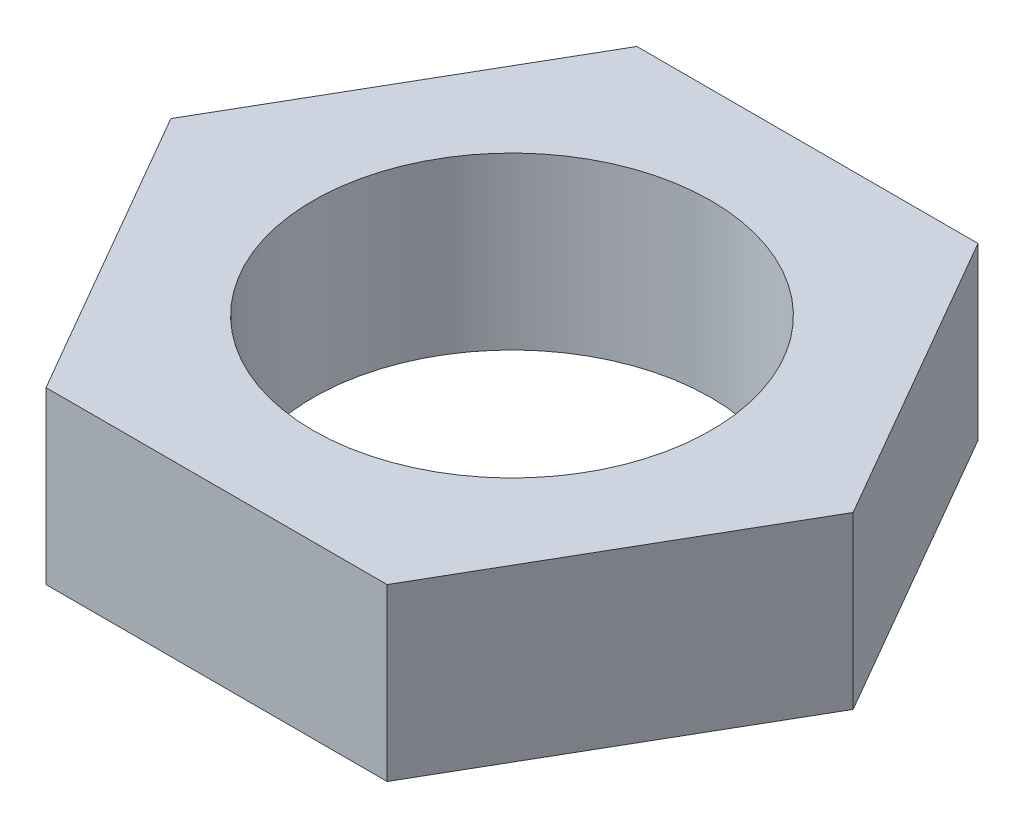
ISO-10303-21;
HEADER;
FILE_DESCRIPTION(('STEP AP214'),'2;1');
FILE_NAME('part.step','',(''),(''),'','','');
FILE_SCHEMA(('AUTOMOTIVE_DESIGN { 1 0 10303 214 1 1 1 1 }'));
ENDSEC;
DATA;
#1=APPLICATION_CONTEXT('core data for automotive mechanical design processes');
#2=APPLICATION_PROTOCOL_DEFINITION('international standard','automotive_design',2000,#1);
#3=PRODUCT_CONTEXT('',#1,'mechanical');
#4=PRODUCT('Part','Part','',(#3));
#5=PRODUCT_RELATED_PRODUCT_CATEGORY('part','',(#4));
#6=PRODUCT_DEFINITION_FORMATION('','',#4);
#7=PRODUCT_DEFINITION_CONTEXT('part definition',#1,'design');
#8=PRODUCT_DEFINITION('design','',#6,#7);
#9=PRODUCT_DEFINITION_SHAPE('','',#8);
#10=(LENGTH_UNIT() NAMED_UNIT(*) SI_UNIT(.MILLI.,.METRE.));
#11=(NAMED_UNIT(*) PLANE_ANGLE_UNIT() SI_UNIT($,.RADIAN.));
#12=(NAMED_UNIT(*) SI_UNIT($,.STERADIAN.) SOLID_ANGLE_UNIT());
#13=UNCERTAINTY_MEASURE_WITH_UNIT(LENGTH_MEASURE(1.E-05),#10,'distance_accuracy_value','');
#14=(GEOMETRIC_REPRESENTATION_CONTEXT(3) GLOBAL_UNCERTAINTY_ASSIGNED_CONTEXT((#13)) GLOBAL_UNIT_ASSIGNED_CONTEXT((#10,
#11,#12)) REPRESENTATION_CONTEXT('',''));
#15=CARTESIAN_POINT('',(0.,0.,0.));
#16=DIRECTION('',(0.,0.,1.));
#17=DIRECTION('',(1.,0.,0.));
#18=AXIS2_PLACEMENT_3D('',#15,#16,#17);
#19=CARTESIAN_POINT('',(3.00000000000005,3.,5.19615242270659));
#20=DIRECTION('',(-0.866025403784441,0.,-0.499999999999995));
#21=DIRECTION('',(-0.499999999999995,0.,0.866025403784442));
#22=AXIS2_PLACEMENT_3D('',#19,#20,#21);
#23=PLANE('',#22);
#24=DIRECTION('',(0.499999999999995,0.,-0.866025403784442));
#25=VECTOR('',#24,1.);
#26=CARTESIAN_POINT('',(3.00000000000005,0.,5.19615242270659));
#27=LINE('',#26,#25);
#28=CARTESIAN_POINT('',(3.00000000000005,0.,5.19615242270659));
#29=VERTEX_POINT('',#28);
#30=CARTESIAN_POINT('',(5.99999999999999,0.,0.));
#31=VERTEX_POINT('',#30);
#32=EDGE_CURVE('E134',#29,#31,#27,.T.);
#33=ORIENTED_EDGE('',*,*,#32,.T.);
#34=DIRECTION('',(0.,-1.,0.));
#35=VECTOR('',#34,1.);
#36=CARTESIAN_POINT('',(5.99999999999999,3.,0.));
#37=LINE('',#36,#35);
#38=CARTESIAN_POINT('',(5.99999999999999,3.,0.));
#39=VERTEX_POINT('',#38);
#40=EDGE_CURVE('E11',#39,#31,#37,.T.);
#41=ORIENTED_EDGE('',*,*,#40,.F.);
#42=DIRECTION('',(0.499999999999995,0.,-0.866025403784442));
#43=VECTOR('',#42,1.);
#44=CARTESIAN_POINT('',(3.00000000000005,3.,5.19615242270659));
#45=LINE('',#44,#43);
#46=CARTESIAN_POINT('',(3.00000000000005,3.,5.19615242270659));
#47=VERTEX_POINT('',#46);
#48=EDGE_CURVE('E151',#47,#39,#45,.T.);
#49=ORIENTED_EDGE('',*,*,#48,.F.);
#50=DIRECTION('',(0.,-1.,0.));
#51=VECTOR('',#50,1.);
#52=CARTESIAN_POINT('',(3.00000000000005,3.,5.19615242270659));
#53=LINE('',#52,#51);
#54=EDGE_CURVE('E130',#47,#29,#53,.T.);
#55=ORIENTED_EDGE('',*,*,#54,.T.);
#56=EDGE_LOOP('',(#33,#41,#49,#55));
#57=FACE_BOUND('',#56,.T.);
#58=ADVANCED_FACE('F45',(#57),#23,.F.);
#59=CARTESIAN_POINT('',(5.99999999999999,3.,0.));
#60=DIRECTION('',(-0.866025403784438,0.,0.500000000000001));
#61=DIRECTION('',(0.500000000000001,0.,0.866025403784438));
#62=AXIS2_PLACEMENT_3D('',#59,#60,#61);
#63=PLANE('',#62);
#64=DIRECTION('',(-0.500000000000001,0.,-0.866025403784438));
#65=VECTOR('',#64,1.);
#66=CARTESIAN_POINT('',(5.99999999999999,0.,0.));
#67=LINE('',#66,#65);
#68=CARTESIAN_POINT('',(2.99999999999998,0.,-5.19615242270663));
#69=VERTEX_POINT('',#68);
#70=EDGE_CURVE('E138',#31,#69,#67,.T.);
#71=ORIENTED_EDGE('',*,*,#70,.T.);
#72=DIRECTION('',(0.,-1.,0.));
#73=VECTOR('',#72,1.);
#74=CARTESIAN_POINT('',(2.99999999999998,3.,-5.19615242270663));
#75=LINE('',#74,#73);
#76=CARTESIAN_POINT('',(2.99999999999998,3.,-5.19615242270663));
#77=VERTEX_POINT('',#76);
#78=EDGE_CURVE('E54',#77,#69,#75,.T.);
#79=ORIENTED_EDGE('',*,*,#78,.F.);
#80=DIRECTION('',(-0.500000000000001,0.,-0.866025403784438));
#81=VECTOR('',#80,1.);
#82=CARTESIAN_POINT('',(5.99999999999999,3.,0.));
#83=LINE('',#82,#81);
#84=EDGE_CURVE('E99',#39,#77,#83,.T.);
#85=ORIENTED_EDGE('',*,*,#84,.F.);
#86=ORIENTED_EDGE('',*,*,#40,.T.);
#87=EDGE_LOOP('',(#71,#79,#85,#86));
#88=FACE_BOUND('',#87,.T.);
#89=ADVANCED_FACE('F180',(#88),#63,.F.);
#90=CARTESIAN_POINT('',(2.99999999999998,3.,-5.19615242270663));
#91=DIRECTION('',(0.,0.,1.));
#92=DIRECTION('',(1.,0.,0.));
#93=AXIS2_PLACEMENT_3D('',#90,#91,#92);
#94=PLANE('',#93);
#95=DIRECTION('',(-1.,0.,0.));
#96=VECTOR('',#95,1.);
#97=CARTESIAN_POINT('',(2.99999999999998,0.,-5.19615242270663));
#98=LINE('',#97,#96);
#99=CARTESIAN_POINT('',(-3.00000000000002,0.,-5.19615242270661));
#100=VERTEX_POINT('',#99);
#101=EDGE_CURVE('E142',#69,#100,#98,.T.);
#102=ORIENTED_EDGE('',*,*,#101,.T.);
#103=DIRECTION('',(0.,-1.,0.));
#104=VECTOR('',#103,1.);
#105=CARTESIAN_POINT('',(-3.00000000000002,3.,-5.19615242270661));
#106=LINE('',#105,#104);
#107=CARTESIAN_POINT('',(-3.00000000000002,3.,-5.19615242270661));
#108=VERTEX_POINT('',#107);
#109=EDGE_CURVE('E123',#108,#100,#106,.T.);
#110=ORIENTED_EDGE('',*,*,#109,.F.);
#111=DIRECTION('',(-1.,0.,0.));
#112=VECTOR('',#111,1.);
#113=CARTESIAN_POINT('',(2.99999999999998,3.,-5.19615242270663));
#114=LINE('',#113,#112);
#115=EDGE_CURVE('E112',#77,#108,#114,.T.);
#116=ORIENTED_EDGE('',*,*,#115,.F.);
#117=ORIENTED_EDGE('',*,*,#78,.T.);
#118=EDGE_LOOP('',(#102,#110,#116,#117));
#119=FACE_BOUND('',#118,.T.);
#120=ADVANCED_FACE('F161',(#119),#94,.F.);
#121=CARTESIAN_POINT('',(-3.00000000000002,3.,-5.19615242270661));
#122=DIRECTION('',(0.866025403784442,0.,0.499999999999995));
#123=DIRECTION('',(0.499999999999995,0.,-0.866025403784442));
#124=AXIS2_PLACEMENT_3D('',#121,#122,#123);
#125=PLANE('',#124);
#126=DIRECTION('',(-0.499999999999995,0.,0.866025403784441));
#127=VECTOR('',#126,1.);
#128=CARTESIAN_POINT('',(-3.00000000000002,0.,-5.19615242270661));
#129=LINE('',#128,#127);
#130=CARTESIAN_POINT('',(-5.99999999999999,0.,0.));
#131=VERTEX_POINT('',#130);
#132=EDGE_CURVE('E121',#100,#131,#129,.T.);
#133=ORIENTED_EDGE('',*,*,#132,.T.);
#134=DIRECTION('',(0.,-1.,0.));
#135=VECTOR('',#134,1.);
#136=CARTESIAN_POINT('',(-5.99999999999999,3.,0.));
#137=LINE('',#136,#135);
#138=CARTESIAN_POINT('',(-5.99999999999999,3.,0.));
#139=VERTEX_POINT('',#138);
#140=EDGE_CURVE('E118',#139,#131,#137,.T.);
#141=ORIENTED_EDGE('',*,*,#140,.F.);
#142=DIRECTION('',(-0.499999999999995,0.,0.866025403784441));
#143=VECTOR('',#142,1.);
#144=CARTESIAN_POINT('',(-3.00000000000002,3.,-5.19615242270661));
#145=LINE('',#144,#143);
#146=EDGE_CURVE('E106',#108,#139,#145,.T.);
#147=ORIENTED_EDGE('',*,*,#146,.F.);
#148=ORIENTED_EDGE('',*,*,#109,.T.);
#149=EDGE_LOOP('',(#133,#141,#147,#148));
#150=FACE_BOUND('',#149,.T.);
#151=ADVANCED_FACE('F119',(#150),#125,.F.);
#152=CARTESIAN_POINT('',(-5.99999999999999,3.,0.));
#153=DIRECTION('',(0.866025403784434,0.,-0.500000000000007));
#154=DIRECTION('',(-0.500000000000007,0.,-0.866025403784435));
#155=AXIS2_PLACEMENT_3D('',#152,#153,#154);
#156=PLANE('',#155);
#157=DIRECTION('',(0.500000000000007,0.,0.866025403784435));
#158=VECTOR('',#157,1.);
#159=CARTESIAN_POINT('',(-5.99999999999999,0.,0.));
#160=LINE('',#159,#158);
#161=CARTESIAN_POINT('',(-2.99999999999995,0.,5.19615242270665));
#162=VERTEX_POINT('',#161);
#163=EDGE_CURVE('E85',#131,#162,#160,.T.);
#164=ORIENTED_EDGE('',*,*,#163,.T.);
#165=DIRECTION('',(0.,-1.,0.));
#166=VECTOR('',#165,1.);
#167=CARTESIAN_POINT('',(-2.99999999999995,3.,5.19615242270665));
#168=LINE('',#167,#166);
#169=CARTESIAN_POINT('',(-2.99999999999995,3.,5.19615242270665));
#170=VERTEX_POINT('',#169);
#171=EDGE_CURVE('E124',#170,#162,#168,.T.);
#172=ORIENTED_EDGE('',*,*,#171,.F.);
#173=DIRECTION('',(0.500000000000007,0.,0.866025403784435));
#174=VECTOR('',#173,1.);
#175=CARTESIAN_POINT('',(-5.99999999999999,3.,0.));
#176=LINE('',#175,#174);
#177=EDGE_CURVE('E110',#139,#170,#176,.T.);
#178=ORIENTED_EDGE('',*,*,#177,.F.);
#179=ORIENTED_EDGE('',*,*,#140,.T.);
#180=EDGE_LOOP('',(#164,#172,#178,#179));
#181=FACE_BOUND('',#180,.T.);
#182=ADVANCED_FACE('F126',(#181),#156,.F.);
#183=CARTESIAN_POINT('',(-2.99999999999995,3.,5.19615242270665));
#184=DIRECTION('',(0.,0.,-1.));
#185=DIRECTION('',(-1.,0.,0.));
#186=AXIS2_PLACEMENT_3D('',#183,#184,#185);
#187=PLANE('',#186);
#188=DIRECTION('',(1.,0.,0.));
#189=VECTOR('',#188,1.);
#190=CARTESIAN_POINT('',(-2.99999999999995,0.,5.19615242270665));
#191=LINE('',#190,#189);
#192=EDGE_CURVE('E91',#162,#29,#191,.T.);
#193=ORIENTED_EDGE('',*,*,#192,.T.);
#194=ORIENTED_EDGE('',*,*,#54,.F.);
#195=DIRECTION('',(1.,0.,0.));
#196=VECTOR('',#195,1.);
#197=CARTESIAN_POINT('',(-2.99999999999995,3.,5.19615242270665));
#198=LINE('',#197,#196);
#199=EDGE_CURVE('E62',#170,#47,#198,.T.);
#200=ORIENTED_EDGE('',*,*,#199,.F.);
#201=ORIENTED_EDGE('',*,*,#171,.T.);
#202=EDGE_LOOP('',(#193,#194,#200,#201));
#203=FACE_BOUND('',#202,.T.);
#204=ADVANCED_FACE('F168',(#203),#187,.F.);
#205=CARTESIAN_POINT('',(0.,3.,0.));
#206=DIRECTION('',(0.,1.,0.));
#207=DIRECTION('',(0.,0.,1.));
#208=AXIS2_PLACEMENT_3D('',#205,#206,#207);
#209=PLANE('',#208);
#210=CARTESIAN_POINT('',(0.,3.,0.));
#211=DIRECTION('',(0.,1.,0.));
#212=DIRECTION('',(0.,0.,1.));
#213=AXIS2_PLACEMENT_3D('',#210,#211,#212);
#214=CIRCLE('',#213,3.5);
#215=CARTESIAN_POINT('',(0.,3.,3.5));
#216=VERTEX_POINT('',#215);
#217=EDGE_CURVE('E236',#216,#216,#214,.T.);
#218=ORIENTED_EDGE('',*,*,#217,.F.);
#219=EDGE_LOOP('',(#218));
#220=FACE_BOUND('',#219,.T.);
#221=ORIENTED_EDGE('',*,*,#48,.T.);
#222=ORIENTED_EDGE('',*,*,#84,.T.);
#223=ORIENTED_EDGE('',*,*,#115,.T.);
#224=ORIENTED_EDGE('',*,*,#146,.T.);
#225=ORIENTED_EDGE('',*,*,#177,.T.);
#226=ORIENTED_EDGE('',*,*,#199,.T.);
#227=EDGE_LOOP('',(#221,#222,#223,#224,#225,#226));
#228=FACE_BOUND('',#227,.T.);
#229=ADVANCED_FACE('F108',(#220,#228),#209,.T.);
#230=CARTESIAN_POINT('',(0.,0.,0.));
#231=DIRECTION('',(0.,1.,0.));
#232=DIRECTION('',(0.,0.,1.));
#233=AXIS2_PLACEMENT_3D('',#230,#231,#232);
#234=PLANE('',#233);
#235=CARTESIAN_POINT('',(0.,0.,0.));
#236=DIRECTION('',(0.,1.,0.));
#237=DIRECTION('',(0.,0.,1.));
#238=AXIS2_PLACEMENT_3D('',#235,#236,#237);
#239=CIRCLE('',#238,3.5);
#240=CARTESIAN_POINT('',(0.,0.,3.5));
#241=VERTEX_POINT('',#240);
#242=EDGE_CURVE('E139',#241,#241,#239,.T.);
#243=ORIENTED_EDGE('',*,*,#242,.T.);
#244=EDGE_LOOP('',(#243));
#245=FACE_BOUND('',#244,.T.);
#246=ORIENTED_EDGE('',*,*,#32,.F.);
#247=ORIENTED_EDGE('',*,*,#192,.F.);
#248=ORIENTED_EDGE('',*,*,#163,.F.);
#249=ORIENTED_EDGE('',*,*,#132,.F.);
#250=ORIENTED_EDGE('',*,*,#101,.F.);
#251=ORIENTED_EDGE('',*,*,#70,.F.);
#252=EDGE_LOOP('',(#246,#247,#248,#249,#250,#251));
#253=FACE_BOUND('',#252,.T.);
#254=ADVANCED_FACE('F164',(#245,#253),#234,.F.);
#255=CARTESIAN_POINT('',(0.,0.,0.));
#256=DIRECTION('',(0.,1.,0.));
#257=DIRECTION('',(0.,0.,1.));
#258=AXIS2_PLACEMENT_3D('',#255,#256,#257);
#259=CYLINDRICAL_SURFACE('',#258,3.5);
#260=ORIENTED_EDGE('',*,*,#242,.F.);
#261=EDGE_LOOP('',(#260));
#262=FACE_BOUND('',#261,.T.);
#263=ORIENTED_EDGE('',*,*,#217,.T.);
#264=EDGE_LOOP('',(#263));
#265=FACE_BOUND('',#264,.T.);
#266=ADVANCED_FACE('F219',(#262,#265),#259,.F.);
#267=CLOSED_SHELL('',(#58,#89,#120,#151,#182,#204,#229,#254,#266));
#268=MANIFOLD_SOLID_BREP('B2',#267);
#269=ADVANCED_BREP_SHAPE_REPRESENTATION('',(#18,#268),#14);
#270=SHAPE_DEFINITION_REPRESENTATION(#9,#269);
ENDSEC;
END-ISO-10303-21;
